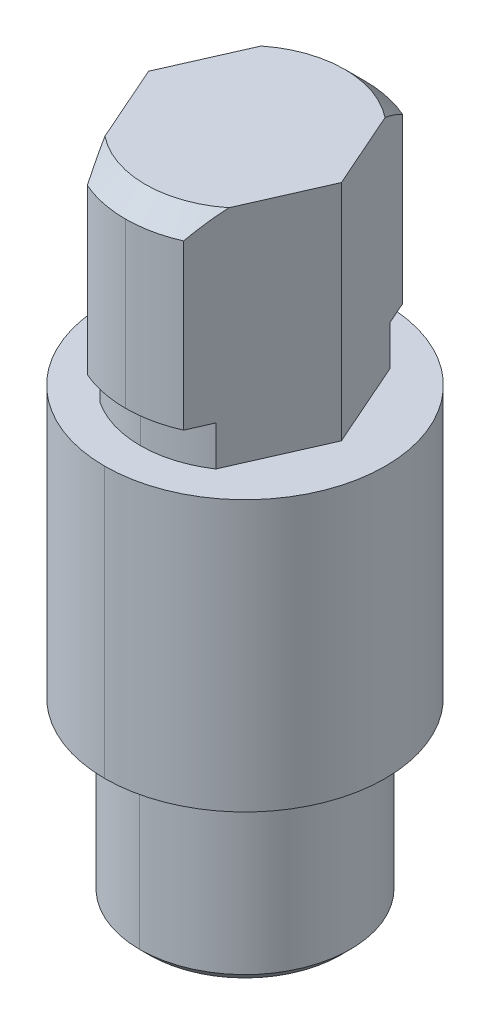
ISO-10303-21;
HEADER;
FILE_DESCRIPTION(('STEP AP214'),'2;1');
FILE_NAME('part.step','',(''),(''),'','','');
FILE_SCHEMA(('AUTOMOTIVE_DESIGN { 1 0 10303 214 1 1 1 1 }'));
ENDSEC;
DATA;
#1=APPLICATION_CONTEXT('core data for automotive mechanical design processes');
#2=APPLICATION_PROTOCOL_DEFINITION('international standard','automotive_design',2000,#1);
#3=PRODUCT_CONTEXT('',#1,'mechanical');
#4=PRODUCT('Part','Part','',(#3));
#5=PRODUCT_RELATED_PRODUCT_CATEGORY('part','',(#4));
#6=PRODUCT_DEFINITION_FORMATION('','',#4);
#7=PRODUCT_DEFINITION_CONTEXT('part definition',#1,'design');
#8=PRODUCT_DEFINITION('design','',#6,#7);
#9=PRODUCT_DEFINITION_SHAPE('','',#8);
#10=(LENGTH_UNIT() NAMED_UNIT(*) SI_UNIT(.MILLI.,.METRE.));
#11=(NAMED_UNIT(*) PLANE_ANGLE_UNIT() SI_UNIT($,.RADIAN.));
#12=(NAMED_UNIT(*) SI_UNIT($,.STERADIAN.) SOLID_ANGLE_UNIT());
#13=UNCERTAINTY_MEASURE_WITH_UNIT(LENGTH_MEASURE(1.E-05),#10,'distance_accuracy_value','');
#14=(GEOMETRIC_REPRESENTATION_CONTEXT(3) GLOBAL_UNCERTAINTY_ASSIGNED_CONTEXT((#13)) GLOBAL_UNIT_ASSIGNED_CONTEXT((#10,
#11,#12)) REPRESENTATION_CONTEXT('',''));
#15=CARTESIAN_POINT('',(0.,0.,0.));
#16=DIRECTION('',(0.,0.,1.));
#17=DIRECTION('',(1.,0.,0.));
#18=AXIS2_PLACEMENT_3D('',#15,#16,#17);
#19=CARTESIAN_POINT('',(0.,22.3865327371101,0.));
#20=DIRECTION('',(0.,-1.,0.));
#21=DIRECTION('',(0.,0.,-1.));
#22=AXIS2_PLACEMENT_3D('',#19,#20,#21);
#23=CONICAL_SURFACE('',#22,3.33333333333031,0.785398163397448);
#24=CARTESIAN_POINT('',(0.,22.3865327371101,0.));
#25=DIRECTION('',(0.,1.,0.));
#26=DIRECTION('',(0.,0.,1.));
#27=AXIS2_PLACEMENT_3D('',#24,#25,#26);
#28=CIRCLE('',#27,3.33333333333031);
#29=CARTESIAN_POINT('',(0.,22.3865327371101,-3.33333333333031));
#30=VERTEX_POINT('',#29);
#31=CARTESIAN_POINT('',(-2.07158395354665,22.3865327371101,-2.61144615768717));
#32=VERTEX_POINT('',#31);
#33=EDGE_CURVE('E42',#30,#32,#28,.T.);
#34=ORIENTED_EDGE('',*,*,#33,.F.);
#35=DIRECTION('',(0.,-0.707106781186548,-0.707106781186548));
#36=VECTOR('',#35,1.);
#37=CARTESIAN_POINT('',(0.,22.3865327371101,-3.33333333333031));
#38=LINE('',#37,#36);
#39=CARTESIAN_POINT('',(0.,21.7198660704441,-3.99999999999636));
#40=VERTEX_POINT('',#39);
#41=EDGE_CURVE('E11',#30,#40,#38,.T.);
#42=ORIENTED_EDGE('',*,*,#41,.T.);
#43=CARTESIAN_POINT('',(0.,21.7198660704441,0.));
#44=DIRECTION('',(0.,1.,0.));
#45=DIRECTION('',(0.,0.,1.));
#46=AXIS2_PLACEMENT_3D('',#43,#44,#45);
#47=CIRCLE('',#46,3.99999999999636);
#48=CARTESIAN_POINT('',(-1.60817379130539,21.7198660704441,-3.66248236267826));
#49=VERTEX_POINT('',#48);
#50=EDGE_CURVE('E28',#40,#49,#47,.T.);
#51=ORIENTED_EDGE('',*,*,#50,.T.);
#52=CARTESIAN_POINT('',(-2.07158395354664,22.3865327371101,-2.61144615768716));
#53=CARTESIAN_POINT('',(-1.86094297070984,22.1431602730504,-3.08918988722828));
#54=CARTESIAN_POINT('',(-1.60817379130539,21.7198660704441,-3.66248236267826));
#55=B_SPLINE_CURVE_WITH_KNOTS('',2,(#52,#53,#54),.UNSPECIFIED.,.F.,.F.,(3,3),(0.,1.),.UNSPECIFIED.);
#56=EDGE_CURVE('E385',#32,#49,#55,.T.);
#57=ORIENTED_EDGE('',*,*,#56,.F.);
#58=EDGE_LOOP('',(#34,#42,#51,#57));
#59=FACE_BOUND('',#58,.T.);
#60=ADVANCED_FACE('F16',(#59),#23,.T.);
#61=CARTESIAN_POINT('',(0.,0.333333333333075,0.));
#62=DIRECTION('',(0.,1.,0.));
#63=DIRECTION('',(0.,0.,1.));
#64=AXIS2_PLACEMENT_3D('',#61,#62,#63);
#65=CONICAL_SURFACE('',#64,3.52329683966718,0.785398163397376);
#66=CARTESIAN_POINT('',(0.,0.,0.));
#67=DIRECTION('',(0.,1.,0.));
#68=DIRECTION('',(0.,0.,1.));
#69=AXIS2_PLACEMENT_3D('',#66,#67,#68);
#70=CIRCLE('',#69,3.18996350633415);
#71=CARTESIAN_POINT('',(0.,0.,3.18996350633415));
#72=VERTEX_POINT('',#71);
#73=CARTESIAN_POINT('',(0.,0.,-3.18996350633415));
#74=VERTEX_POINT('',#73);
#75=EDGE_CURVE('E349',#72,#74,#70,.T.);
#76=ORIENTED_EDGE('',*,*,#75,.T.);
#77=DIRECTION('',(0.,0.707106781186599,-0.707106781186496));
#78=VECTOR('',#77,1.);
#79=CARTESIAN_POINT('',(0.,0.333333333333075,-3.52329683966718));
#80=LINE('',#79,#78);
#81=CARTESIAN_POINT('',(0.,0.333333333333075,-3.52329683966718));
#82=VERTEX_POINT('',#81);
#83=EDGE_CURVE('E352',#74,#82,#80,.T.);
#84=ORIENTED_EDGE('',*,*,#83,.T.);
#85=CARTESIAN_POINT('',(0.,0.333333333333075,0.));
#86=DIRECTION('',(0.,1.,0.));
#87=DIRECTION('',(0.,0.,1.));
#88=AXIS2_PLACEMENT_3D('',#85,#86,#87);
#89=CIRCLE('',#88,3.52329683966718);
#90=CARTESIAN_POINT('',(0.,0.333333333333075,3.52329683966718));
#91=VERTEX_POINT('',#90);
#92=EDGE_CURVE('E366',#91,#82,#89,.T.);
#93=ORIENTED_EDGE('',*,*,#92,.F.);
#94=DIRECTION('',(0.,0.707106781186599,0.707106781186496));
#95=VECTOR('',#94,1.);
#96=CARTESIAN_POINT('',(0.,0.333333333333075,3.52329683966718));
#97=LINE('',#96,#95);
#98=EDGE_CURVE('E188',#72,#91,#97,.T.);
#99=ORIENTED_EDGE('',*,*,#98,.F.);
#100=EDGE_LOOP('',(#76,#84,#93,#99));
#101=FACE_BOUND('',#100,.T.);
#102=ADVANCED_FACE('F482',(#101),#65,.T.);
#103=CARTESIAN_POINT('',(0.,22.3865327371101,0.));
#104=DIRECTION('',(0.,1.,0.));
#105=DIRECTION('',(0.,0.,1.));
#106=AXIS2_PLACEMENT_3D('',#103,#104,#105);
#107=CYLINDRICAL_SURFACE('',#106,3.52329683966718);
#108=ORIENTED_EDGE('',*,*,#92,.T.);
#109=DIRECTION('',(0.,1.,0.));
#110=VECTOR('',#109,1.);
#111=CARTESIAN_POINT('',(0.,22.3865327371101,-3.52329683966718));
#112=LINE('',#111,#110);
#113=CARTESIAN_POINT('',(0.,5.04567816023155,-3.52329683966718));
#114=VERTEX_POINT('',#113);
#115=EDGE_CURVE('E426',#82,#114,#112,.T.);
#116=ORIENTED_EDGE('',*,*,#115,.T.);
#117=CARTESIAN_POINT('',(0.,5.04567816023155,0.));
#118=DIRECTION('',(0.,1.,0.));
#119=DIRECTION('',(0.,0.,1.));
#120=AXIS2_PLACEMENT_3D('',#117,#118,#119);
#121=CIRCLE('',#120,3.52329683966718);
#122=CARTESIAN_POINT('',(0.,5.04567816023155,3.52329683966718));
#123=VERTEX_POINT('',#122);
#124=EDGE_CURVE('E389',#123,#114,#121,.T.);
#125=ORIENTED_EDGE('',*,*,#124,.F.);
#126=DIRECTION('',(0.,1.,0.));
#127=VECTOR('',#126,1.);
#128=CARTESIAN_POINT('',(0.,22.3865327371101,3.52329683966718));
#129=LINE('',#128,#127);
#130=EDGE_CURVE('E331',#91,#123,#129,.T.);
#131=ORIENTED_EDGE('',*,*,#130,.F.);
#132=EDGE_LOOP('',(#108,#116,#125,#131));
#133=FACE_BOUND('',#132,.T.);
#134=ADVANCED_FACE('F825',(#133),#107,.T.);
#135=CARTESIAN_POINT('',(0.,5.38118173643853,0.));
#136=DIRECTION('',(0.,-1.,0.));
#137=DIRECTION('',(0.,0.,-1.));
#138=AXIS2_PLACEMENT_3D('',#135,#136,#137);
#139=CONICAL_SURFACE('',#138,3.37992701267058,0.403840212732483);
#140=CARTESIAN_POINT('',(0.,5.38118173643853,0.));
#141=DIRECTION('',(0.,1.,0.));
#142=DIRECTION('',(0.,0.,1.));
#143=AXIS2_PLACEMENT_3D('',#140,#141,#142);
#144=CIRCLE('',#143,3.37992701267058);
#145=CARTESIAN_POINT('',(0.,5.38118173643853,3.37992701267058));
#146=VERTEX_POINT('',#145);
#147=CARTESIAN_POINT('',(0.,5.38118173643853,-3.37992701267058));
#148=VERTEX_POINT('',#147);
#149=EDGE_CURVE('E386',#146,#148,#144,.T.);
#150=ORIENTED_EDGE('',*,*,#149,.F.);
#151=DIRECTION('',(0.,-0.91955875685953,0.392952532353407));
#152=VECTOR('',#151,1.);
#153=CARTESIAN_POINT('',(0.,5.38118173643853,3.37992701267058));
#154=LINE('',#153,#152);
#155=EDGE_CURVE('E431',#146,#123,#154,.T.);
#156=ORIENTED_EDGE('',*,*,#155,.T.);
#157=ORIENTED_EDGE('',*,*,#124,.T.);
#158=DIRECTION('',(0.,-0.91955875685953,-0.392952532353407));
#159=VECTOR('',#158,1.);
#160=CARTESIAN_POINT('',(0.,5.38118173643853,-3.37992701267058));
#161=LINE('',#160,#159);
#162=EDGE_CURVE('E104',#148,#114,#161,.T.);
#163=ORIENTED_EDGE('',*,*,#162,.F.);
#164=EDGE_LOOP('',(#150,#156,#157,#163));
#165=FACE_BOUND('',#164,.T.);
#166=ADVANCED_FACE('F288',(#165),#139,.T.);
#167=CARTESIAN_POINT('',(0.,22.3865327371101,0.));
#168=DIRECTION('',(0.,1.,0.));
#169=DIRECTION('',(0.,0.,1.));
#170=AXIS2_PLACEMENT_3D('',#167,#168,#169);
#171=CYLINDRICAL_SURFACE('',#170,3.37992701267058);
#172=ORIENTED_EDGE('',*,*,#149,.T.);
#173=DIRECTION('',(0.,1.,0.));
#174=VECTOR('',#173,1.);
#175=CARTESIAN_POINT('',(0.,22.3865327371101,-3.37992701267058));
#176=LINE('',#175,#174);
#177=CARTESIAN_POINT('',(0.,5.86575682221041,-3.37992701267058));
#178=VERTEX_POINT('',#177);
#179=EDGE_CURVE('E390',#148,#178,#176,.T.);
#180=ORIENTED_EDGE('',*,*,#179,.T.);
#181=CARTESIAN_POINT('',(0.,5.86575682221041,0.));
#182=DIRECTION('',(0.,1.,0.));
#183=DIRECTION('',(0.,0.,1.));
#184=AXIS2_PLACEMENT_3D('',#181,#182,#183);
#185=CIRCLE('',#184,3.37992701267058);
#186=CARTESIAN_POINT('',(0.,5.86575682221041,3.37992701267058));
#187=VERTEX_POINT('',#186);
#188=EDGE_CURVE('E453',#187,#178,#185,.T.);
#189=ORIENTED_EDGE('',*,*,#188,.F.);
#190=DIRECTION('',(0.,1.,0.));
#191=VECTOR('',#190,1.);
#192=CARTESIAN_POINT('',(0.,22.3865327371101,3.37992701267058));
#193=LINE('',#192,#191);
#194=EDGE_CURVE('E91',#146,#187,#193,.T.);
#195=ORIENTED_EDGE('',*,*,#194,.F.);
#196=EDGE_LOOP('',(#172,#180,#189,#195));
#197=FACE_BOUND('',#196,.T.);
#198=ADVANCED_FACE('F882',(#197),#171,.T.);
#199=CARTESIAN_POINT('',(0.,22.3865327371101,0.));
#200=DIRECTION('',(0.,1.,0.));
#201=DIRECTION('',(0.,0.,1.));
#202=AXIS2_PLACEMENT_3D('',#199,#200,#201);
#203=CYLINDRICAL_SURFACE('',#202,4.6899635063329);
#204=CARTESIAN_POINT('',(0.,5.86575682221052,0.));
#205=DIRECTION('',(0.,1.,0.));
#206=DIRECTION('',(0.,0.,1.));
#207=AXIS2_PLACEMENT_3D('',#204,#205,#206);
#208=CIRCLE('',#207,4.68996350633302);
#209=CARTESIAN_POINT('',(0.,5.86575682221052,4.68996350633302));
#210=VERTEX_POINT('',#209);
#211=CARTESIAN_POINT('',(0.,5.86575682221052,-4.68996350633302));
#212=VERTEX_POINT('',#211);
#213=EDGE_CURVE('E430',#210,#212,#208,.T.);
#214=ORIENTED_EDGE('',*,*,#213,.T.);
#215=DIRECTION('',(0.,1.,0.));
#216=VECTOR('',#215,1.);
#217=CARTESIAN_POINT('',(0.,22.3865327371101,-4.6899635063329));
#218=LINE('',#217,#216);
#219=CARTESIAN_POINT('',(0.,14.9075247376742,-4.68996350633279));
#220=VERTEX_POINT('',#219);
#221=EDGE_CURVE('E378',#212,#220,#218,.T.);
#222=ORIENTED_EDGE('',*,*,#221,.T.);
#223=CARTESIAN_POINT('',(0.,14.9075247376742,0.));
#224=DIRECTION('',(0.,1.,0.));
#225=DIRECTION('',(0.,0.,1.));
#226=AXIS2_PLACEMENT_3D('',#223,#224,#225);
#227=CIRCLE('',#226,4.68996350633279);
#228=CARTESIAN_POINT('',(0.,14.9075247376742,4.68996350633279));
#229=VERTEX_POINT('',#228);
#230=EDGE_CURVE('E384',#229,#220,#227,.T.);
#231=ORIENTED_EDGE('',*,*,#230,.F.);
#232=DIRECTION('',(0.,1.,0.));
#233=VECTOR('',#232,1.);
#234=CARTESIAN_POINT('',(0.,22.3865327371101,4.6899635063329));
#235=LINE('',#234,#233);
#236=EDGE_CURVE('E325',#210,#229,#235,.T.);
#237=ORIENTED_EDGE('',*,*,#236,.F.);
#238=EDGE_LOOP('',(#214,#222,#231,#237));
#239=FACE_BOUND('',#238,.T.);
#240=ADVANCED_FACE('F886',(#239),#203,.T.);
#241=CARTESIAN_POINT('',(0.,22.3865327371101,0.));
#242=DIRECTION('',(0.,1.,0.));
#243=DIRECTION('',(0.,0.,1.));
#244=AXIS2_PLACEMENT_3D('',#241,#242,#243);
#245=CYLINDRICAL_SURFACE('',#244,3.49999999999727);
#246=CARTESIAN_POINT('',(0.,14.9075247376742,0.));
#247=DIRECTION('',(0.,1.,0.));
#248=DIRECTION('',(0.,0.,1.));
#249=AXIS2_PLACEMENT_3D('',#246,#247,#248);
#250=CIRCLE('',#249,3.49999999999727);
#251=CARTESIAN_POINT('',(-1.93796716131992,14.9075247376742,2.91449537340969));
#252=VERTEX_POINT('',#251);
#253=CARTESIAN_POINT('',(0.,14.9075247376742,3.49999999999727));
#254=VERTEX_POINT('',#253);
#255=EDGE_CURVE('E374',#252,#254,#250,.T.);
#256=ORIENTED_EDGE('',*,*,#255,.T.);
#257=DIRECTION('',(0.,1.,0.));
#258=VECTOR('',#257,1.);
#259=CARTESIAN_POINT('',(0.,22.3865327371101,3.49999999999727));
#260=LINE('',#259,#258);
#261=CARTESIAN_POINT('',(0.,16.2408580710061,3.49999999999727));
#262=VERTEX_POINT('',#261);
#263=EDGE_CURVE('E379',#254,#262,#260,.T.);
#264=ORIENTED_EDGE('',*,*,#263,.T.);
#265=CARTESIAN_POINT('',(0.,16.2408580710061,0.));
#266=DIRECTION('',(0.,1.,0.));
#267=DIRECTION('',(0.,0.,1.));
#268=AXIS2_PLACEMENT_3D('',#265,#266,#267);
#269=CIRCLE('',#268,3.49999999999727);
#270=CARTESIAN_POINT('',(-1.93796716131992,16.2408580710061,2.91449537340969));
#271=VERTEX_POINT('',#270);
#272=EDGE_CURVE('E336',#271,#262,#269,.T.);
#273=ORIENTED_EDGE('',*,*,#272,.F.);
#274=DIRECTION('',(0.,1.,0.));
#275=VECTOR('',#274,1.);
#276=CARTESIAN_POINT('',(-1.93796716131992,22.3865327371101,2.91449537340969));
#277=LINE('',#276,#275);
#278=EDGE_CURVE('E408',#252,#271,#277,.T.);
#279=ORIENTED_EDGE('',*,*,#278,.F.);
#280=EDGE_LOOP('',(#256,#264,#273,#279));
#281=FACE_BOUND('',#280,.T.);
#282=ADVANCED_FACE('F890',(#281),#245,.T.);
#283=CARTESIAN_POINT('',(0.,22.3865327371101,0.));
#284=DIRECTION('',(0.,1.,0.));
#285=DIRECTION('',(0.,0.,1.));
#286=AXIS2_PLACEMENT_3D('',#283,#284,#285);
#287=CYLINDRICAL_SURFACE('',#286,3.99999999999636);
#288=CARTESIAN_POINT('',(0.,16.2408580710061,0.));
#289=DIRECTION('',(0.,1.,0.));
#290=DIRECTION('',(0.,0.,1.));
#291=AXIS2_PLACEMENT_3D('',#288,#289,#290);
#292=CIRCLE('',#291,3.99999999999636);
#293=CARTESIAN_POINT('',(-1.60817379130539,16.2408580710061,3.66248236267826));
#294=VERTEX_POINT('',#293);
#295=CARTESIAN_POINT('',(0.,16.2408580710061,3.99999999999636));
#296=VERTEX_POINT('',#295);
#297=EDGE_CURVE('E441',#294,#296,#292,.T.);
#298=ORIENTED_EDGE('',*,*,#297,.T.);
#299=DIRECTION('',(0.,1.,0.));
#300=VECTOR('',#299,1.);
#301=CARTESIAN_POINT('',(0.,22.3865327371101,3.99999999999636));
#302=LINE('',#301,#300);
#303=CARTESIAN_POINT('',(0.,21.7198660704441,3.99999999999636));
#304=VERTEX_POINT('',#303);
#305=EDGE_CURVE('E445',#296,#304,#302,.T.);
#306=ORIENTED_EDGE('',*,*,#305,.T.);
#307=CARTESIAN_POINT('',(0.,21.7198660704441,0.));
#308=DIRECTION('',(0.,1.,0.));
#309=DIRECTION('',(0.,0.,1.));
#310=AXIS2_PLACEMENT_3D('',#307,#308,#309);
#311=CIRCLE('',#310,3.99999999999636);
#312=CARTESIAN_POINT('',(-1.60817379130539,21.7198660704441,3.66248236267826));
#313=VERTEX_POINT('',#312);
#314=EDGE_CURVE('E538',#313,#304,#311,.T.);
#315=ORIENTED_EDGE('',*,*,#314,.F.);
#316=DIRECTION('',(0.,1.,0.));
#317=VECTOR('',#316,1.);
#318=CARTESIAN_POINT('',(-1.60817379130539,22.3865327371101,3.66248236267826));
#319=LINE('',#318,#317);
#320=EDGE_CURVE('E409',#294,#313,#319,.T.);
#321=ORIENTED_EDGE('',*,*,#320,.F.);
#322=EDGE_LOOP('',(#298,#306,#315,#321));
#323=FACE_BOUND('',#322,.T.);
#324=ADVANCED_FACE('F515',(#323),#287,.T.);
#325=CARTESIAN_POINT('',(0.,22.3865327371101,0.));
#326=DIRECTION('',(0.,-1.,0.));
#327=DIRECTION('',(0.,0.,-1.));
#328=AXIS2_PLACEMENT_3D('',#325,#326,#327);
#329=CONICAL_SURFACE('',#328,3.33333333333031,0.785398163397448);
#330=CARTESIAN_POINT('',(2.07158395354664,22.3865327371101,2.61144615768716));
#331=CARTESIAN_POINT('',(1.86094297070984,22.1431602730504,3.08918988722828));
#332=CARTESIAN_POINT('',(1.60817379130539,21.7198660704441,3.66248236267826));
#333=B_SPLINE_CURVE_WITH_KNOTS('',2,(#330,#331,#332),.UNSPECIFIED.,.F.,.F.,(3,3),(0.,1.),.UNSPECIFIED.);
#334=CARTESIAN_POINT('',(2.07158395354665,22.3865327371101,2.61144615768717));
#335=VERTEX_POINT('',#334);
#336=CARTESIAN_POINT('',(1.60817379130539,21.7198660704441,3.66248236267826));
#337=VERTEX_POINT('',#336);
#338=EDGE_CURVE('E541',#335,#337,#333,.T.);
#339=ORIENTED_EDGE('',*,*,#338,.F.);
#340=CARTESIAN_POINT('',(0.,22.3865327371101,0.));
#341=DIRECTION('',(0.,1.,0.));
#342=DIRECTION('',(0.,0.,1.));
#343=AXIS2_PLACEMENT_3D('',#340,#341,#342);
#344=CIRCLE('',#343,3.33333333333031);
#345=CARTESIAN_POINT('',(-2.07158395354665,22.3865327371101,2.61144615768717));
#346=VERTEX_POINT('',#345);
#347=EDGE_CURVE('E251',#346,#335,#344,.T.);
#348=ORIENTED_EDGE('',*,*,#347,.F.);
#349=CARTESIAN_POINT('',(-1.60817379130539,21.7198660704441,3.66248236267826));
#350=CARTESIAN_POINT('',(-1.86094297070971,22.1431602730502,3.08918988722857));
#351=CARTESIAN_POINT('',(-2.07158395354664,22.3865327371101,2.61144615768716));
#352=B_SPLINE_CURVE_WITH_KNOTS('',2,(#349,#350,#351),.UNSPECIFIED.,.F.,.F.,(3,3),(0.,1.),.UNSPECIFIED.);
#353=EDGE_CURVE('E499',#313,#346,#352,.T.);
#354=ORIENTED_EDGE('',*,*,#353,.F.);
#355=ORIENTED_EDGE('',*,*,#314,.T.);
#356=CARTESIAN_POINT('',(0.,21.7198660704441,0.));
#357=DIRECTION('',(0.,1.,0.));
#358=DIRECTION('',(0.,0.,1.));
#359=AXIS2_PLACEMENT_3D('',#356,#357,#358);
#360=CIRCLE('',#359,3.99999999999636);
#361=EDGE_CURVE('E344',#304,#337,#360,.T.);
#362=ORIENTED_EDGE('',*,*,#361,.T.);
#363=EDGE_LOOP('',(#339,#348,#354,#355,#362));
#364=FACE_BOUND('',#363,.T.);
#365=ADVANCED_FACE('F505',(#364),#329,.T.);
#366=CARTESIAN_POINT('',(0.,22.3865327371101,0.));
#367=DIRECTION('',(0.,1.,0.));
#368=DIRECTION('',(0.,0.,1.));
#369=AXIS2_PLACEMENT_3D('',#366,#367,#368);
#370=CYLINDRICAL_SURFACE('',#369,3.99999999999636);
#371=ORIENTED_EDGE('',*,*,#305,.F.);
#372=CARTESIAN_POINT('',(0.,16.2408580710061,0.));
#373=DIRECTION('',(0.,1.,0.));
#374=DIRECTION('',(0.,0.,1.));
#375=AXIS2_PLACEMENT_3D('',#372,#373,#374);
#376=CIRCLE('',#375,3.99999999999636);
#377=CARTESIAN_POINT('',(1.60817379130539,16.2408580710061,3.66248236267826));
#378=VERTEX_POINT('',#377);
#379=EDGE_CURVE('E339',#296,#378,#376,.T.);
#380=ORIENTED_EDGE('',*,*,#379,.T.);
#381=DIRECTION('',(0.,-1.,0.));
#382=VECTOR('',#381,1.);
#383=CARTESIAN_POINT('',(1.60817379130539,22.3865327371101,3.66248236267826));
#384=LINE('',#383,#382);
#385=EDGE_CURVE('E329',#337,#378,#384,.T.);
#386=ORIENTED_EDGE('',*,*,#385,.F.);
#387=ORIENTED_EDGE('',*,*,#361,.F.);
#388=EDGE_LOOP('',(#371,#380,#386,#387));
#389=FACE_BOUND('',#388,.T.);
#390=ADVANCED_FACE('F282',(#389),#370,.T.);
#391=CARTESIAN_POINT('',(0.,16.2408580710061,0.));
#392=DIRECTION('',(0.,-1.,0.));
#393=DIRECTION('',(0.,0.,-1.));
#394=AXIS2_PLACEMENT_3D('',#391,#392,#393);
#395=PLANE('',#394);
#396=DIRECTION('',(0.403434487284577,0.,-0.915008532457174));
#397=VECTOR('',#396,1.);
#398=CARTESIAN_POINT('',(2.69841912069431,16.2408580710061,1.18975429826078));
#399=LINE('',#398,#397);
#400=CARTESIAN_POINT('',(1.93796716131992,16.2408580710061,2.91449537340969));
#401=VERTEX_POINT('',#400);
#402=EDGE_CURVE('E327',#378,#401,#399,.T.);
#403=ORIENTED_EDGE('',*,*,#402,.F.);
#404=ORIENTED_EDGE('',*,*,#379,.F.);
#405=ORIENTED_EDGE('',*,*,#297,.F.);
#406=DIRECTION('',(0.403434487284577,0.,0.915008532457174));
#407=VECTOR('',#406,1.);
#408=CARTESIAN_POINT('',(-2.69841912069431,16.2408580710061,1.18975429826078));
#409=LINE('',#408,#407);
#410=EDGE_CURVE('E404',#271,#294,#409,.T.);
#411=ORIENTED_EDGE('',*,*,#410,.F.);
#412=ORIENTED_EDGE('',*,*,#272,.T.);
#413=CARTESIAN_POINT('',(0.,16.2408580710061,0.));
#414=DIRECTION('',(0.,1.,0.));
#415=DIRECTION('',(0.,0.,1.));
#416=AXIS2_PLACEMENT_3D('',#413,#414,#415);
#417=CIRCLE('',#416,3.49999999999727);
#418=EDGE_CURVE('E340',#262,#401,#417,.T.);
#419=ORIENTED_EDGE('',*,*,#418,.T.);
#420=EDGE_LOOP('',(#403,#404,#405,#411,#412,#419));
#421=FACE_BOUND('',#420,.T.);
#422=ADVANCED_FACE('F278',(#421),#395,.T.);
#423=CARTESIAN_POINT('',(0.,22.3865327371101,0.));
#424=DIRECTION('',(0.,1.,0.));
#425=DIRECTION('',(0.,0.,1.));
#426=AXIS2_PLACEMENT_3D('',#423,#424,#425);
#427=CYLINDRICAL_SURFACE('',#426,3.49999999999727);
#428=ORIENTED_EDGE('',*,*,#263,.F.);
#429=CARTESIAN_POINT('',(0.,14.9075247376742,0.));
#430=DIRECTION('',(0.,1.,0.));
#431=DIRECTION('',(0.,0.,1.));
#432=AXIS2_PLACEMENT_3D('',#429,#430,#431);
#433=CIRCLE('',#432,3.49999999999727);
#434=CARTESIAN_POINT('',(1.93796716131992,14.9075247376742,2.91449537340969));
#435=VERTEX_POINT('',#434);
#436=EDGE_CURVE('E418',#254,#435,#433,.T.);
#437=ORIENTED_EDGE('',*,*,#436,.T.);
#438=DIRECTION('',(0.,-1.,0.));
#439=VECTOR('',#438,1.);
#440=CARTESIAN_POINT('',(1.93796716131992,22.3865327371101,2.91449537340969));
#441=LINE('',#440,#439);
#442=EDGE_CURVE('E330',#401,#435,#441,.T.);
#443=ORIENTED_EDGE('',*,*,#442,.F.);
#444=ORIENTED_EDGE('',*,*,#418,.F.);
#445=EDGE_LOOP('',(#428,#437,#443,#444));
#446=FACE_BOUND('',#445,.T.);
#447=ADVANCED_FACE('F281',(#446),#427,.T.);
#448=CARTESIAN_POINT('',(0.,22.3865327371101,0.));
#449=DIRECTION('',(0.,1.,0.));
#450=DIRECTION('',(0.,0.,1.));
#451=AXIS2_PLACEMENT_3D('',#448,#449,#450);
#452=CYLINDRICAL_SURFACE('',#451,4.6899635063329);
#453=ORIENTED_EDGE('',*,*,#221,.F.);
#454=CARTESIAN_POINT('',(0.,5.86575682221052,0.));
#455=DIRECTION('',(0.,1.,0.));
#456=DIRECTION('',(0.,0.,1.));
#457=AXIS2_PLACEMENT_3D('',#454,#455,#456);
#458=CIRCLE('',#457,4.68996350633302);
#459=EDGE_CURVE('E422',#212,#210,#458,.T.);
#460=ORIENTED_EDGE('',*,*,#459,.T.);
#461=ORIENTED_EDGE('',*,*,#236,.T.);
#462=CARTESIAN_POINT('',(0.,14.9075247376742,0.));
#463=DIRECTION('',(0.,1.,0.));
#464=DIRECTION('',(0.,0.,1.));
#465=AXIS2_PLACEMENT_3D('',#462,#463,#464);
#466=CIRCLE('',#465,4.68996350633279);
#467=EDGE_CURVE('E380',#220,#229,#466,.T.);
#468=ORIENTED_EDGE('',*,*,#467,.F.);
#469=EDGE_LOOP('',(#453,#460,#461,#468));
#470=FACE_BOUND('',#469,.T.);
#471=ADVANCED_FACE('F842',(#470),#452,.T.);
#472=CARTESIAN_POINT('',(4.9710815785471E-13,5.86575682221047,0.));
#473=DIRECTION('',(0.,-1.,0.));
#474=DIRECTION('',(0.,0.,-1.));
#475=AXIS2_PLACEMENT_3D('',#472,#473,#474);
#476=PLANE('',#475);
#477=ORIENTED_EDGE('',*,*,#213,.F.);
#478=ORIENTED_EDGE('',*,*,#459,.F.);
#479=EDGE_LOOP('',(#477,#478));
#480=FACE_BOUND('',#479,.T.);
#481=ORIENTED_EDGE('',*,*,#188,.T.);
#482=CARTESIAN_POINT('',(0.,5.86575682221041,0.));
#483=DIRECTION('',(0.,1.,0.));
#484=DIRECTION('',(0.,0.,1.));
#485=AXIS2_PLACEMENT_3D('',#482,#483,#484);
#486=CIRCLE('',#485,3.37992701267058);
#487=EDGE_CURVE('E394',#178,#187,#486,.T.);
#488=ORIENTED_EDGE('',*,*,#487,.T.);
#489=EDGE_LOOP('',(#481,#488));
#490=FACE_BOUND('',#489,.T.);
#491=ADVANCED_FACE('F838',(#480,#490),#476,.T.);
#492=CARTESIAN_POINT('',(0.,22.3865327371101,0.));
#493=DIRECTION('',(0.,1.,0.));
#494=DIRECTION('',(0.,0.,1.));
#495=AXIS2_PLACEMENT_3D('',#492,#493,#494);
#496=CYLINDRICAL_SURFACE('',#495,3.37992701267058);
#497=ORIENTED_EDGE('',*,*,#179,.F.);
#498=CARTESIAN_POINT('',(0.,5.38118173643853,0.));
#499=DIRECTION('',(0.,1.,0.));
#500=DIRECTION('',(0.,0.,1.));
#501=AXIS2_PLACEMENT_3D('',#498,#499,#500);
#502=CIRCLE('',#501,3.37992701267058);
#503=EDGE_CURVE('E369',#148,#146,#502,.T.);
#504=ORIENTED_EDGE('',*,*,#503,.T.);
#505=ORIENTED_EDGE('',*,*,#194,.T.);
#506=ORIENTED_EDGE('',*,*,#487,.F.);
#507=EDGE_LOOP('',(#497,#504,#505,#506));
#508=FACE_BOUND('',#507,.T.);
#509=ADVANCED_FACE('F516',(#508),#496,.T.);
#510=CARTESIAN_POINT('',(0.,5.38118173643853,0.));
#511=DIRECTION('',(0.,-1.,0.));
#512=DIRECTION('',(0.,0.,-1.));
#513=AXIS2_PLACEMENT_3D('',#510,#511,#512);
#514=CONICAL_SURFACE('',#513,3.37992701267058,0.403840212732483);
#515=ORIENTED_EDGE('',*,*,#155,.F.);
#516=ORIENTED_EDGE('',*,*,#503,.F.);
#517=ORIENTED_EDGE('',*,*,#162,.T.);
#518=CARTESIAN_POINT('',(0.,5.04567816023155,0.));
#519=DIRECTION('',(0.,1.,0.));
#520=DIRECTION('',(0.,0.,1.));
#521=AXIS2_PLACEMENT_3D('',#518,#519,#520);
#522=CIRCLE('',#521,3.52329683966718);
#523=EDGE_CURVE('E356',#114,#123,#522,.T.);
#524=ORIENTED_EDGE('',*,*,#523,.T.);
#525=EDGE_LOOP('',(#515,#516,#517,#524));
#526=FACE_BOUND('',#525,.T.);
#527=ADVANCED_FACE('F848',(#526),#514,.T.);
#528=CARTESIAN_POINT('',(0.,22.3865327371101,0.));
#529=DIRECTION('',(0.,1.,0.));
#530=DIRECTION('',(0.,0.,1.));
#531=AXIS2_PLACEMENT_3D('',#528,#529,#530);
#532=CYLINDRICAL_SURFACE('',#531,3.52329683966718);
#533=ORIENTED_EDGE('',*,*,#115,.F.);
#534=CARTESIAN_POINT('',(0.,0.333333333333075,0.));
#535=DIRECTION('',(0.,1.,0.));
#536=DIRECTION('',(0.,0.,1.));
#537=AXIS2_PLACEMENT_3D('',#534,#535,#536);
#538=CIRCLE('',#537,3.52329683966718);
#539=EDGE_CURVE('E334',#82,#91,#538,.T.);
#540=ORIENTED_EDGE('',*,*,#539,.T.);
#541=ORIENTED_EDGE('',*,*,#130,.T.);
#542=ORIENTED_EDGE('',*,*,#523,.F.);
#543=EDGE_LOOP('',(#533,#540,#541,#542));
#544=FACE_BOUND('',#543,.T.);
#545=ADVANCED_FACE('F852',(#544),#532,.T.);
#546=CARTESIAN_POINT('',(0.,0.333333333333075,0.));
#547=DIRECTION('',(0.,1.,0.));
#548=DIRECTION('',(0.,0.,1.));
#549=AXIS2_PLACEMENT_3D('',#546,#547,#548);
#550=CONICAL_SURFACE('',#549,3.52329683966718,0.785398163397376);
#551=ORIENTED_EDGE('',*,*,#83,.F.);
#552=CARTESIAN_POINT('',(0.,0.,0.));
#553=DIRECTION('',(0.,1.,0.));
#554=DIRECTION('',(0.,0.,1.));
#555=AXIS2_PLACEMENT_3D('',#552,#553,#554);
#556=CIRCLE('',#555,3.18996350633415);
#557=EDGE_CURVE('E335',#74,#72,#556,.T.);
#558=ORIENTED_EDGE('',*,*,#557,.T.);
#559=ORIENTED_EDGE('',*,*,#98,.T.);
#560=ORIENTED_EDGE('',*,*,#539,.F.);
#561=EDGE_LOOP('',(#551,#558,#559,#560));
#562=FACE_BOUND('',#561,.T.);
#563=ADVANCED_FACE('F905',(#562),#550,.T.);
#564=CARTESIAN_POINT('',(0.,0.,0.));
#565=DIRECTION('',(0.,-1.,0.));
#566=DIRECTION('',(0.,0.,-1.));
#567=AXIS2_PLACEMENT_3D('',#564,#565,#566);
#568=PLANE('',#567);
#569=ORIENTED_EDGE('',*,*,#75,.F.);
#570=ORIENTED_EDGE('',*,*,#557,.F.);
#571=EDGE_LOOP('',(#569,#570));
#572=FACE_BOUND('',#571,.T.);
#573=ADVANCED_FACE('F914',(#572),#568,.T.);
#574=CARTESIAN_POINT('',(0.,22.3865327371101,0.));
#575=DIRECTION('',(0.,-1.,0.));
#576=DIRECTION('',(0.,0.,-1.));
#577=AXIS2_PLACEMENT_3D('',#574,#575,#576);
#578=PLANE('',#577);
#579=ORIENTED_EDGE('',*,*,#347,.T.);
#580=DIRECTION('',(-0.403434487284577,0.,0.915008532457174));
#581=VECTOR('',#580,1.);
#582=CARTESIAN_POINT('',(0.985125070326682,22.3865327371101,5.07558638278626));
#583=LINE('',#582,#581);
#584=CARTESIAN_POINT('',(3.22299118563943,22.3865327371101,0.));
#585=VERTEX_POINT('',#584);
#586=EDGE_CURVE('E236',#585,#335,#583,.T.);
#587=ORIENTED_EDGE('',*,*,#586,.F.);
#588=DIRECTION('',(0.403434487284577,0.,0.915008532457174));
#589=VECTOR('',#588,1.);
#590=CARTESIAN_POINT('',(0.985125070326682,22.3865327371101,-5.07558638278626));
#591=LINE('',#590,#589);
#592=CARTESIAN_POINT('',(2.07158395354665,22.3865327371101,-2.61144615768717));
#593=VERTEX_POINT('',#592);
#594=EDGE_CURVE('E230',#593,#585,#591,.T.);
#595=ORIENTED_EDGE('',*,*,#594,.F.);
#596=CARTESIAN_POINT('',(0.,22.3865327371101,0.));
#597=DIRECTION('',(0.,1.,0.));
#598=DIRECTION('',(0.,0.,1.));
#599=AXIS2_PLACEMENT_3D('',#596,#597,#598);
#600=CIRCLE('',#599,3.33333333333031);
#601=EDGE_CURVE('E234',#593,#30,#600,.T.);
#602=ORIENTED_EDGE('',*,*,#601,.T.);
#603=ORIENTED_EDGE('',*,*,#33,.T.);
#604=DIRECTION('',(0.403434487284577,0.,-0.915008532457174));
#605=VECTOR('',#604,1.);
#606=CARTESIAN_POINT('',(-0.985125070326682,22.3865327371101,-5.07558638278626));
#607=LINE('',#606,#605);
#608=CARTESIAN_POINT('',(-3.22299118563943,22.3865327371101,0.));
#609=VERTEX_POINT('',#608);
#610=EDGE_CURVE('E362',#609,#32,#607,.T.);
#611=ORIENTED_EDGE('',*,*,#610,.F.);
#612=DIRECTION('',(-0.403434487284577,0.,-0.915008532457174));
#613=VECTOR('',#612,1.);
#614=CARTESIAN_POINT('',(-0.985125070326682,22.3865327371101,5.07558638278626));
#615=LINE('',#614,#613);
#616=EDGE_CURVE('E449',#346,#609,#615,.T.);
#617=ORIENTED_EDGE('',*,*,#616,.F.);
#618=EDGE_LOOP('',(#579,#587,#595,#602,#603,#611,#617));
#619=FACE_BOUND('',#618,.T.);
#620=ADVANCED_FACE('F233',(#619),#578,.F.);
#621=CARTESIAN_POINT('',(0.,22.3865327371101,0.));
#622=DIRECTION('',(0.,-1.,0.));
#623=DIRECTION('',(0.,0.,-1.));
#624=AXIS2_PLACEMENT_3D('',#621,#622,#623);
#625=CONICAL_SURFACE('',#624,3.33333333333031,0.785398163397448);
#626=ORIENTED_EDGE('',*,*,#41,.F.);
#627=ORIENTED_EDGE('',*,*,#601,.F.);
#628=CARTESIAN_POINT('',(1.60817379130539,21.7198660704441,-3.66248236267826));
#629=CARTESIAN_POINT('',(1.86094297070971,22.1431602730502,-3.08918988722857));
#630=CARTESIAN_POINT('',(2.07158395354664,22.3865327371101,-2.61144615768716));
#631=B_SPLINE_CURVE_WITH_KNOTS('',2,(#628,#629,#630),.UNSPECIFIED.,.F.,.F.,(3,3),(0.,1.),.UNSPECIFIED.);
#632=CARTESIAN_POINT('',(1.60817379130539,21.7198660704441,-3.66248236267826));
#633=VERTEX_POINT('',#632);
#634=EDGE_CURVE('E242',#633,#593,#631,.T.);
#635=ORIENTED_EDGE('',*,*,#634,.F.);
#636=CARTESIAN_POINT('',(0.,21.7198660704441,0.));
#637=DIRECTION('',(0.,1.,0.));
#638=DIRECTION('',(0.,0.,1.));
#639=AXIS2_PLACEMENT_3D('',#636,#637,#638);
#640=CIRCLE('',#639,3.99999999999636);
#641=EDGE_CURVE('E293',#633,#40,#640,.T.);
#642=ORIENTED_EDGE('',*,*,#641,.T.);
#643=EDGE_LOOP('',(#626,#627,#635,#642));
#644=FACE_BOUND('',#643,.T.);
#645=ADVANCED_FACE('F246',(#644),#625,.T.);
#646=CARTESIAN_POINT('',(0.,22.3865327371101,0.));
#647=DIRECTION('',(0.,1.,0.));
#648=DIRECTION('',(0.,0.,1.));
#649=AXIS2_PLACEMENT_3D('',#646,#647,#648);
#650=CYLINDRICAL_SURFACE('',#649,3.99999999999636);
#651=DIRECTION('',(0.,1.,0.));
#652=VECTOR('',#651,1.);
#653=CARTESIAN_POINT('',(1.60817379130539,22.3865327371101,-3.66248236267826));
#654=LINE('',#653,#652);
#655=CARTESIAN_POINT('',(1.60817379130539,16.2408580710061,-3.66248236267826));
#656=VERTEX_POINT('',#655);
#657=EDGE_CURVE('E257',#656,#633,#654,.T.);
#658=ORIENTED_EDGE('',*,*,#657,.F.);
#659=CARTESIAN_POINT('',(0.,16.2408580710061,0.));
#660=DIRECTION('',(0.,1.,0.));
#661=DIRECTION('',(0.,0.,1.));
#662=AXIS2_PLACEMENT_3D('',#659,#660,#661);
#663=CIRCLE('',#662,3.99999999999636);
#664=CARTESIAN_POINT('',(-1.60817379130539,16.2408580710061,-3.66248236267826));
#665=VERTEX_POINT('',#664);
#666=EDGE_CURVE('E301',#656,#665,#663,.T.);
#667=ORIENTED_EDGE('',*,*,#666,.T.);
#668=DIRECTION('',(0.,-1.,0.));
#669=VECTOR('',#668,1.);
#670=CARTESIAN_POINT('',(-1.60817379130539,22.3865327371101,-3.66248236267826));
#671=LINE('',#670,#669);
#672=EDGE_CURVE('E608',#49,#665,#671,.T.);
#673=ORIENTED_EDGE('',*,*,#672,.F.);
#674=ORIENTED_EDGE('',*,*,#50,.F.);
#675=ORIENTED_EDGE('',*,*,#641,.F.);
#676=EDGE_LOOP('',(#658,#667,#673,#674,#675));
#677=FACE_BOUND('',#676,.T.);
#678=ADVANCED_FACE('F287',(#677),#650,.T.);
#679=CARTESIAN_POINT('',(0.,16.2408580710061,0.));
#680=DIRECTION('',(0.,-1.,0.));
#681=DIRECTION('',(0.,0.,-1.));
#682=AXIS2_PLACEMENT_3D('',#679,#680,#681);
#683=PLANE('',#682);
#684=DIRECTION('',(-0.403434487284577,0.,-0.915008532457174));
#685=VECTOR('',#684,1.);
#686=CARTESIAN_POINT('',(2.69841912069431,16.2408580710061,-1.18975429826078));
#687=LINE('',#686,#685);
#688=CARTESIAN_POINT('',(1.93796716131992,16.2408580710061,-2.91449537340969));
#689=VERTEX_POINT('',#688);
#690=EDGE_CURVE('E306',#689,#656,#687,.T.);
#691=ORIENTED_EDGE('',*,*,#690,.F.);
#692=CARTESIAN_POINT('',(0.,16.2408580710061,0.));
#693=DIRECTION('',(0.,1.,0.));
#694=DIRECTION('',(0.,0.,1.));
#695=AXIS2_PLACEMENT_3D('',#692,#693,#694);
#696=CIRCLE('',#695,3.49999999999727);
#697=CARTESIAN_POINT('',(-1.93796716131992,16.2408580710061,-2.91449537340969));
#698=VERTEX_POINT('',#697);
#699=EDGE_CURVE('E348',#689,#698,#696,.T.);
#700=ORIENTED_EDGE('',*,*,#699,.T.);
#701=DIRECTION('',(-0.403434487284577,0.,0.915008532457174));
#702=VECTOR('',#701,1.);
#703=CARTESIAN_POINT('',(-2.69841912069431,16.2408580710061,-1.18975429826078));
#704=LINE('',#703,#702);
#705=EDGE_CURVE('E403',#665,#698,#704,.T.);
#706=ORIENTED_EDGE('',*,*,#705,.F.);
#707=ORIENTED_EDGE('',*,*,#666,.F.);
#708=EDGE_LOOP('',(#691,#700,#706,#707));
#709=FACE_BOUND('',#708,.T.);
#710=ADVANCED_FACE('F829',(#709),#683,.T.);
#711=CARTESIAN_POINT('',(0.,22.3865327371101,0.));
#712=DIRECTION('',(0.,1.,0.));
#713=DIRECTION('',(0.,0.,1.));
#714=AXIS2_PLACEMENT_3D('',#711,#712,#713);
#715=CYLINDRICAL_SURFACE('',#714,3.49999999999727);
#716=DIRECTION('',(0.,1.,0.));
#717=VECTOR('',#716,1.);
#718=CARTESIAN_POINT('',(1.93796716131992,22.3865327371101,-2.91449537340969));
#719=LINE('',#718,#717);
#720=CARTESIAN_POINT('',(1.93796716131992,14.9075247376742,-2.91449537340969));
#721=VERTEX_POINT('',#720);
#722=EDGE_CURVE('E314',#721,#689,#719,.T.);
#723=ORIENTED_EDGE('',*,*,#722,.F.);
#724=CARTESIAN_POINT('',(0.,14.9075247376742,0.));
#725=DIRECTION('',(0.,1.,0.));
#726=DIRECTION('',(0.,0.,1.));
#727=AXIS2_PLACEMENT_3D('',#724,#725,#726);
#728=CIRCLE('',#727,3.49999999999727);
#729=CARTESIAN_POINT('',(-1.93796716131992,14.9075247376742,-2.91449537340969));
#730=VERTEX_POINT('',#729);
#731=EDGE_CURVE('E372',#721,#730,#728,.T.);
#732=ORIENTED_EDGE('',*,*,#731,.T.);
#733=DIRECTION('',(0.,-1.,0.));
#734=VECTOR('',#733,1.);
#735=CARTESIAN_POINT('',(-1.93796716131992,22.3865327371101,-2.91449537340969));
#736=LINE('',#735,#734);
#737=EDGE_CURVE('E400',#698,#730,#736,.T.);
#738=ORIENTED_EDGE('',*,*,#737,.F.);
#739=ORIENTED_EDGE('',*,*,#699,.F.);
#740=EDGE_LOOP('',(#723,#732,#738,#739));
#741=FACE_BOUND('',#740,.T.);
#742=ADVANCED_FACE('F833',(#741),#715,.T.);
#743=CARTESIAN_POINT('',(0.,14.9075247376742,0.));
#744=DIRECTION('',(0.,1.,0.));
#745=DIRECTION('',(1.,0.,0.));
#746=AXIS2_PLACEMENT_3D('',#743,#744,#745);
#747=PLANE('',#746);
#748=ORIENTED_EDGE('',*,*,#230,.T.);
#749=ORIENTED_EDGE('',*,*,#467,.T.);
#750=EDGE_LOOP('',(#748,#749));
#751=FACE_BOUND('',#750,.T.);
#752=ORIENTED_EDGE('',*,*,#731,.F.);
#753=DIRECTION('',(-0.403434487284577,0.,-0.915008532457174));
#754=VECTOR('',#753,1.);
#755=CARTESIAN_POINT('',(0.985125070326682,14.9075247376742,-5.07558638278626));
#756=LINE('',#755,#754);
#757=CARTESIAN_POINT('',(3.22299118563943,14.9075247376742,0.));
#758=VERTEX_POINT('',#757);
#759=EDGE_CURVE('E243',#758,#721,#756,.T.);
#760=ORIENTED_EDGE('',*,*,#759,.F.);
#761=DIRECTION('',(0.403434487284577,0.,-0.915008532457174));
#762=VECTOR('',#761,1.);
#763=CARTESIAN_POINT('',(0.985125070326682,14.9075247376742,5.07558638278626));
#764=LINE('',#763,#762);
#765=EDGE_CURVE('E395',#435,#758,#764,.T.);
#766=ORIENTED_EDGE('',*,*,#765,.F.);
#767=ORIENTED_EDGE('',*,*,#436,.F.);
#768=ORIENTED_EDGE('',*,*,#255,.F.);
#769=DIRECTION('',(0.403434487284577,0.,0.915008532457174));
#770=VECTOR('',#769,1.);
#771=CARTESIAN_POINT('',(-0.985125070326682,14.9075247376742,5.07558638278626));
#772=LINE('',#771,#770);
#773=CARTESIAN_POINT('',(-3.22299118563943,14.9075247376742,0.));
#774=VERTEX_POINT('',#773);
#775=EDGE_CURVE('E437',#774,#252,#772,.T.);
#776=ORIENTED_EDGE('',*,*,#775,.F.);
#777=DIRECTION('',(-0.403434487284577,0.,0.915008532457174));
#778=VECTOR('',#777,1.);
#779=CARTESIAN_POINT('',(-0.985125070326682,14.9075247376742,-5.07558638278626));
#780=LINE('',#779,#778);
#781=EDGE_CURVE('E361',#730,#774,#780,.T.);
#782=ORIENTED_EDGE('',*,*,#781,.F.);
#783=EDGE_LOOP('',(#752,#760,#766,#767,#768,#776,#782));
#784=FACE_BOUND('',#783,.T.);
#785=ADVANCED_FACE('F276',(#751,#784),#747,.T.);
#786=CARTESIAN_POINT('',(-0.985125070326682,3.76791682990969,-5.07558638278626));
#787=DIRECTION('',(0.915008532457174,0.,0.403434487284577));
#788=DIRECTION('',(0.,-1.,0.));
#789=AXIS2_PLACEMENT_3D('',#786,#787,#788);
#790=PLANE('',#789);
#791=ORIENTED_EDGE('',*,*,#56,.T.);
#792=ORIENTED_EDGE('',*,*,#672,.T.);
#793=ORIENTED_EDGE('',*,*,#705,.T.);
#794=ORIENTED_EDGE('',*,*,#737,.T.);
#795=ORIENTED_EDGE('',*,*,#781,.T.);
#796=DIRECTION('',(0.,1.,0.));
#797=VECTOR('',#796,1.);
#798=CARTESIAN_POINT('',(-3.22299118563943,3.76791682990969,0.));
#799=LINE('',#798,#797);
#800=EDGE_CURVE('E357',#774,#609,#799,.T.);
#801=ORIENTED_EDGE('',*,*,#800,.T.);
#802=ORIENTED_EDGE('',*,*,#610,.T.);
#803=EDGE_LOOP('',(#791,#792,#793,#794,#795,#801,#802));
#804=FACE_BOUND('',#803,.T.);
#805=ADVANCED_FACE('F468',(#804),#790,.F.);
#806=CARTESIAN_POINT('',(-0.985125070326682,3.76791682990969,5.07558638278626));
#807=DIRECTION('',(0.915008532457174,0.,-0.403434487284577));
#808=DIRECTION('',(0.,-1.,0.));
#809=AXIS2_PLACEMENT_3D('',#806,#807,#808);
#810=PLANE('',#809);
#811=ORIENTED_EDGE('',*,*,#353,.T.);
#812=ORIENTED_EDGE('',*,*,#616,.T.);
#813=ORIENTED_EDGE('',*,*,#800,.F.);
#814=ORIENTED_EDGE('',*,*,#775,.T.);
#815=ORIENTED_EDGE('',*,*,#278,.T.);
#816=ORIENTED_EDGE('',*,*,#410,.T.);
#817=ORIENTED_EDGE('',*,*,#320,.T.);
#818=EDGE_LOOP('',(#811,#812,#813,#814,#815,#816,#817));
#819=FACE_BOUND('',#818,.T.);
#820=ADVANCED_FACE('F477',(#819),#810,.F.);
#821=CARTESIAN_POINT('',(0.985125070326682,3.76791682990969,5.07558638278626));
#822=DIRECTION('',(-0.915008532457174,0.,-0.403434487284577));
#823=DIRECTION('',(-0.403434487284577,0.,0.915008532457174));
#824=AXIS2_PLACEMENT_3D('',#821,#822,#823);
#825=PLANE('',#824);
#826=ORIENTED_EDGE('',*,*,#338,.T.);
#827=ORIENTED_EDGE('',*,*,#385,.T.);
#828=ORIENTED_EDGE('',*,*,#402,.T.);
#829=ORIENTED_EDGE('',*,*,#442,.T.);
#830=ORIENTED_EDGE('',*,*,#765,.T.);
#831=DIRECTION('',(0.,1.,0.));
#832=VECTOR('',#831,1.);
#833=CARTESIAN_POINT('',(3.22299118563943,3.76791682990969,0.));
#834=LINE('',#833,#832);
#835=EDGE_CURVE('E399',#758,#585,#834,.T.);
#836=ORIENTED_EDGE('',*,*,#835,.T.);
#837=ORIENTED_EDGE('',*,*,#586,.T.);
#838=EDGE_LOOP('',(#826,#827,#828,#829,#830,#836,#837));
#839=FACE_BOUND('',#838,.T.);
#840=ADVANCED_FACE('F18',(#839),#825,.F.);
#841=CARTESIAN_POINT('',(0.985125070326682,3.76791682990969,-5.07558638278626));
#842=DIRECTION('',(-0.915008532457174,0.,0.403434487284577));
#843=DIRECTION('',(0.,1.,0.));
#844=AXIS2_PLACEMENT_3D('',#841,#842,#843);
#845=PLANE('',#844);
#846=ORIENTED_EDGE('',*,*,#634,.T.);
#847=ORIENTED_EDGE('',*,*,#594,.T.);
#848=ORIENTED_EDGE('',*,*,#835,.F.);
#849=ORIENTED_EDGE('',*,*,#759,.T.);
#850=ORIENTED_EDGE('',*,*,#722,.T.);
#851=ORIENTED_EDGE('',*,*,#690,.T.);
#852=ORIENTED_EDGE('',*,*,#657,.T.);
#853=EDGE_LOOP('',(#846,#847,#848,#849,#850,#851,#852));
#854=FACE_BOUND('',#853,.T.);
#855=ADVANCED_FACE('F254',(#854),#845,.F.);
#856=CLOSED_SHELL('',(#60,#102,#134,#166,#198,#240,#282,#324,#365,#390,#422,#447,#471,#491,#509,
#527,#545,#563,#573,#620,#645,#678,#710,#742,#785,#805,#820,#840,#855));
#857=MANIFOLD_SOLID_BREP('B1',#856);
#858=ADVANCED_BREP_SHAPE_REPRESENTATION('',(#18,#857),#14);
#859=SHAPE_DEFINITION_REPRESENTATION(#9,#858);
ENDSEC;
END-ISO-10303-21;
